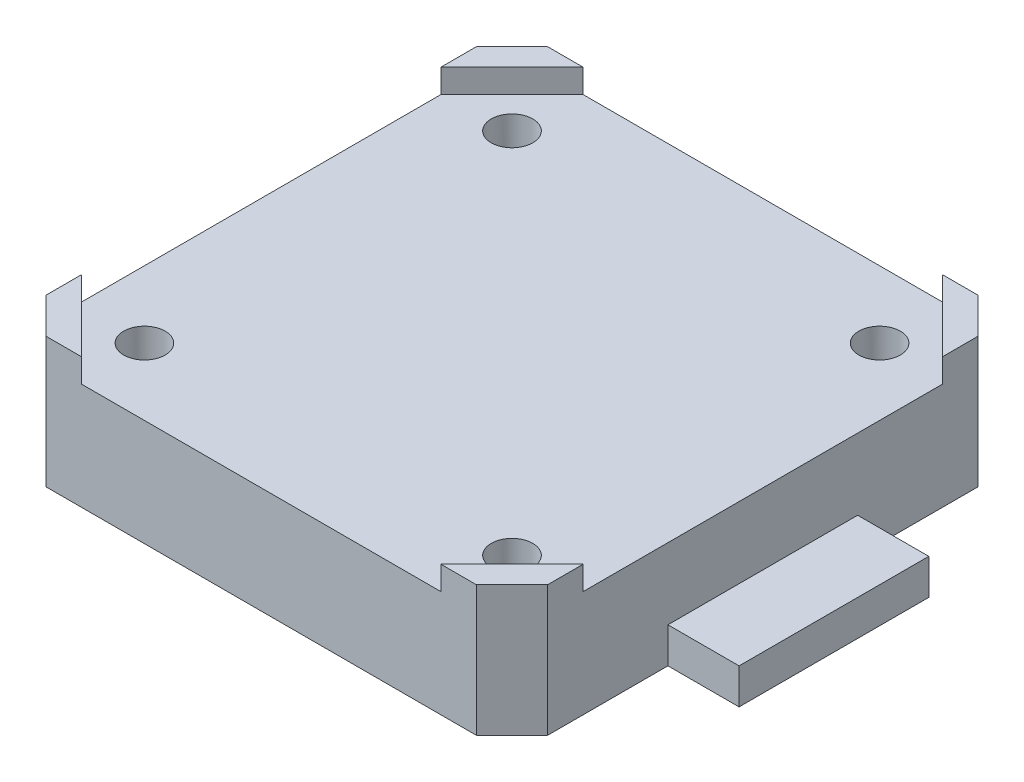
ISO-10303-21;
HEADER;
FILE_DESCRIPTION(('STEP AP214'),'2;1');
FILE_NAME('part.step','',(''),(''),'','','');
FILE_SCHEMA(('AUTOMOTIVE_DESIGN { 1 0 10303 214 1 1 1 1 }'));
ENDSEC;
DATA;
#1=APPLICATION_CONTEXT('core data for automotive mechanical design processes');
#2=APPLICATION_PROTOCOL_DEFINITION('international standard','automotive_design',2000,#1);
#3=PRODUCT_CONTEXT('',#1,'mechanical');
#4=PRODUCT('Part','Part','',(#3));
#5=PRODUCT_RELATED_PRODUCT_CATEGORY('part','',(#4));
#6=PRODUCT_DEFINITION_FORMATION('','',#4);
#7=PRODUCT_DEFINITION_CONTEXT('part definition',#1,'design');
#8=PRODUCT_DEFINITION('design','',#6,#7);
#9=PRODUCT_DEFINITION_SHAPE('','',#8);
#10=(LENGTH_UNIT() NAMED_UNIT(*) SI_UNIT(.MILLI.,.METRE.));
#11=(NAMED_UNIT(*) PLANE_ANGLE_UNIT() SI_UNIT($,.RADIAN.));
#12=(NAMED_UNIT(*) SI_UNIT($,.STERADIAN.) SOLID_ANGLE_UNIT());
#13=UNCERTAINTY_MEASURE_WITH_UNIT(LENGTH_MEASURE(1.E-05),#10,'distance_accuracy_value','');
#14=(GEOMETRIC_REPRESENTATION_CONTEXT(3) GLOBAL_UNCERTAINTY_ASSIGNED_CONTEXT((#13)) GLOBAL_UNIT_ASSIGNED_CONTEXT((#10,
#11,#12)) REPRESENTATION_CONTEXT('',''));
#15=CARTESIAN_POINT('',(0.,0.,0.));
#16=DIRECTION('',(0.,0.,1.));
#17=DIRECTION('',(1.,0.,0.));
#18=AXIS2_PLACEMENT_3D('',#15,#16,#17);
#19=CARTESIAN_POINT('',(0.,0.,0.));
#20=DIRECTION('',(0.,1.,0.));
#21=DIRECTION('',(1.,0.,0.));
#22=AXIS2_PLACEMENT_3D('',#19,#20,#21);
#23=PLANE('',#22);
#24=CARTESIAN_POINT('',(15.5,0.,-15.5));
#25=DIRECTION('',(0.,1.,0.));
#26=DIRECTION('',(0.,0.,-1.));
#27=AXIS2_PLACEMENT_3D('',#24,#25,#26);
#28=CIRCLE('',#27,2.875);
#29=CARTESIAN_POINT('',(15.5,0.,-18.375));
#30=VERTEX_POINT('',#29);
#31=CARTESIAN_POINT('',(15.5,0.,-12.625));
#32=VERTEX_POINT('',#31);
#33=EDGE_CURVE('E354',#30,#32,#28,.T.);
#34=ORIENTED_EDGE('',*,*,#33,.T.);
#35=CARTESIAN_POINT('',(15.5,0.,-15.5));
#36=DIRECTION('',(0.,1.,0.));
#37=DIRECTION('',(0.,0.,-1.));
#38=AXIS2_PLACEMENT_3D('',#35,#36,#37);
#39=CIRCLE('',#38,2.875);
#40=EDGE_CURVE('E183',#32,#30,#39,.T.);
#41=ORIENTED_EDGE('',*,*,#40,.T.);
#42=EDGE_LOOP('',(#34,#41));
#43=FACE_BOUND('',#42,.T.);
#44=CARTESIAN_POINT('',(-15.5,0.,15.5));
#45=DIRECTION('',(0.,1.,0.));
#46=DIRECTION('',(0.,0.,-1.));
#47=AXIS2_PLACEMENT_3D('',#44,#45,#46);
#48=CIRCLE('',#47,2.875);
#49=CARTESIAN_POINT('',(-15.5,0.,12.625));
#50=VERTEX_POINT('',#49);
#51=CARTESIAN_POINT('',(-15.5,0.,18.375));
#52=VERTEX_POINT('',#51);
#53=EDGE_CURVE('E420',#50,#52,#48,.T.);
#54=ORIENTED_EDGE('',*,*,#53,.T.);
#55=CARTESIAN_POINT('',(-15.5,0.,15.5));
#56=DIRECTION('',(0.,1.,0.));
#57=DIRECTION('',(0.,0.,-1.));
#58=AXIS2_PLACEMENT_3D('',#55,#56,#57);
#59=CIRCLE('',#58,2.875);
#60=EDGE_CURVE('E312',#52,#50,#59,.T.);
#61=ORIENTED_EDGE('',*,*,#60,.T.);
#62=EDGE_LOOP('',(#54,#61));
#63=FACE_BOUND('',#62,.T.);
#64=CARTESIAN_POINT('',(15.5,0.,15.5));
#65=DIRECTION('',(0.,1.,0.));
#66=DIRECTION('',(0.,0.,-1.));
#67=AXIS2_PLACEMENT_3D('',#64,#65,#66);
#68=CIRCLE('',#67,2.875);
#69=CARTESIAN_POINT('',(15.5,0.,12.625));
#70=VERTEX_POINT('',#69);
#71=CARTESIAN_POINT('',(15.5,0.,18.375));
#72=VERTEX_POINT('',#71);
#73=EDGE_CURVE('E479',#70,#72,#68,.T.);
#74=ORIENTED_EDGE('',*,*,#73,.T.);
#75=CARTESIAN_POINT('',(15.5,0.,15.5));
#76=DIRECTION('',(0.,1.,0.));
#77=DIRECTION('',(0.,0.,-1.));
#78=AXIS2_PLACEMENT_3D('',#75,#76,#77);
#79=CIRCLE('',#78,2.875);
#80=EDGE_CURVE('E359',#72,#70,#79,.T.);
#81=ORIENTED_EDGE('',*,*,#80,.T.);
#82=EDGE_LOOP('',(#74,#81));
#83=FACE_BOUND('',#82,.T.);
#84=CARTESIAN_POINT('',(-15.5,0.,-15.5));
#85=DIRECTION('',(0.,1.,0.));
#86=DIRECTION('',(0.,0.,-1.));
#87=AXIS2_PLACEMENT_3D('',#84,#85,#86);
#88=CIRCLE('',#87,2.875);
#89=CARTESIAN_POINT('',(-15.5,0.,-18.375));
#90=VERTEX_POINT('',#89);
#91=CARTESIAN_POINT('',(-15.5,0.,-12.625));
#92=VERTEX_POINT('',#91);
#93=EDGE_CURVE('E415',#90,#92,#88,.T.);
#94=ORIENTED_EDGE('',*,*,#93,.T.);
#95=CARTESIAN_POINT('',(-15.5,0.,-15.5));
#96=DIRECTION('',(0.,1.,0.));
#97=DIRECTION('',(0.,0.,-1.));
#98=AXIS2_PLACEMENT_3D('',#95,#96,#97);
#99=CIRCLE('',#98,2.875);
#100=EDGE_CURVE('E345',#92,#90,#99,.T.);
#101=ORIENTED_EDGE('',*,*,#100,.T.);
#102=EDGE_LOOP('',(#94,#101));
#103=FACE_BOUND('',#102,.T.);
#104=DIRECTION('',(-0.707106781186531,0.,-0.707106781186564));
#105=VECTOR('',#104,1.);
#106=CARTESIAN_POINT('',(21.15,0.,-18.15));
#107=LINE('',#106,#105);
#108=CARTESIAN_POINT('',(21.15,0.,-18.15));
#109=VERTEX_POINT('',#108);
#110=CARTESIAN_POINT('',(18.15,0.,-21.15));
#111=VERTEX_POINT('',#110);
#112=EDGE_CURVE('E11',#109,#111,#107,.T.);
#113=ORIENTED_EDGE('',*,*,#112,.F.);
#114=DIRECTION('',(0.,0.,-1.));
#115=VECTOR('',#114,1.);
#116=CARTESIAN_POINT('',(21.15,0.,18.15));
#117=LINE('',#116,#115);
#118=CARTESIAN_POINT('',(21.15,0.,-8.));
#119=VERTEX_POINT('',#118);
#120=EDGE_CURVE('E563',#119,#109,#117,.T.);
#121=ORIENTED_EDGE('',*,*,#120,.F.);
#122=DIRECTION('',(1.,0.,0.));
#123=VECTOR('',#122,1.);
#124=CARTESIAN_POINT('',(21.15,0.,-8.));
#125=LINE('',#124,#123);
#126=CARTESIAN_POINT('',(27.15,0.,-8.));
#127=VERTEX_POINT('',#126);
#128=EDGE_CURVE('E430',#119,#127,#125,.T.);
#129=ORIENTED_EDGE('',*,*,#128,.T.);
#130=DIRECTION('',(0.,0.,-1.));
#131=VECTOR('',#130,1.);
#132=CARTESIAN_POINT('',(27.15,0.,8.));
#133=LINE('',#132,#131);
#134=CARTESIAN_POINT('',(27.15,0.,8.));
#135=VERTEX_POINT('',#134);
#136=EDGE_CURVE('E512',#135,#127,#133,.T.);
#137=ORIENTED_EDGE('',*,*,#136,.F.);
#138=DIRECTION('',(1.,0.,0.));
#139=VECTOR('',#138,1.);
#140=CARTESIAN_POINT('',(21.15,0.,8.));
#141=LINE('',#140,#139);
#142=CARTESIAN_POINT('',(21.15,0.,8.));
#143=VERTEX_POINT('',#142);
#144=EDGE_CURVE('E429',#143,#135,#141,.T.);
#145=ORIENTED_EDGE('',*,*,#144,.F.);
#146=DIRECTION('',(0.,0.,-1.));
#147=VECTOR('',#146,1.);
#148=CARTESIAN_POINT('',(21.15,0.,18.15));
#149=LINE('',#148,#147);
#150=CARTESIAN_POINT('',(21.15,0.,18.15));
#151=VERTEX_POINT('',#150);
#152=EDGE_CURVE('E387',#151,#143,#149,.T.);
#153=ORIENTED_EDGE('',*,*,#152,.F.);
#154=DIRECTION('',(-0.707106781186531,0.,0.707106781186564));
#155=VECTOR('',#154,1.);
#156=CARTESIAN_POINT('',(21.15,0.,18.15));
#157=LINE('',#156,#155);
#158=CARTESIAN_POINT('',(18.15,0.,21.15));
#159=VERTEX_POINT('',#158);
#160=EDGE_CURVE('E372',#151,#159,#157,.T.);
#161=ORIENTED_EDGE('',*,*,#160,.T.);
#162=DIRECTION('',(1.,0.,0.));
#163=VECTOR('',#162,1.);
#164=CARTESIAN_POINT('',(-18.15,0.,21.15));
#165=LINE('',#164,#163);
#166=CARTESIAN_POINT('',(-18.15,0.,21.15));
#167=VERTEX_POINT('',#166);
#168=EDGE_CURVE('E371',#167,#159,#165,.T.);
#169=ORIENTED_EDGE('',*,*,#168,.F.);
#170=DIRECTION('',(0.707106781186548,0.,0.707106781186548));
#171=VECTOR('',#170,1.);
#172=CARTESIAN_POINT('',(-21.15,0.,18.15));
#173=LINE('',#172,#171);
#174=CARTESIAN_POINT('',(-21.15,0.,18.15));
#175=VERTEX_POINT('',#174);
#176=EDGE_CURVE('E491',#175,#167,#173,.T.);
#177=ORIENTED_EDGE('',*,*,#176,.F.);
#178=DIRECTION('',(0.,0.,1.));
#179=VECTOR('',#178,1.);
#180=CARTESIAN_POINT('',(-21.15,0.,-18.15));
#181=LINE('',#180,#179);
#182=CARTESIAN_POINT('',(-21.15,0.,-18.15));
#183=VERTEX_POINT('',#182);
#184=EDGE_CURVE('E490',#183,#175,#181,.T.);
#185=ORIENTED_EDGE('',*,*,#184,.F.);
#186=DIRECTION('',(0.707106781186548,0.,-0.707106781186548));
#187=VECTOR('',#186,1.);
#188=CARTESIAN_POINT('',(-21.15,0.,-18.15));
#189=LINE('',#188,#187);
#190=CARTESIAN_POINT('',(-18.15,0.,-21.15));
#191=VERTEX_POINT('',#190);
#192=EDGE_CURVE('E376',#183,#191,#189,.T.);
#193=ORIENTED_EDGE('',*,*,#192,.T.);
#194=DIRECTION('',(-1.,0.,0.));
#195=VECTOR('',#194,1.);
#196=CARTESIAN_POINT('',(18.15,0.,-21.15));
#197=LINE('',#196,#195);
#198=EDGE_CURVE('E334',#111,#191,#197,.T.);
#199=ORIENTED_EDGE('',*,*,#198,.F.);
#200=EDGE_LOOP('',(#113,#121,#129,#137,#145,#153,#161,#169,#177,#185,#193,#199));
#201=FACE_BOUND('',#200,.T.);
#202=ADVANCED_FACE('F16',(#43,#63,#83,#103,#201),#23,.F.);
#203=CARTESIAN_POINT('',(0.,9.,0.));
#204=DIRECTION('',(0.,1.,0.));
#205=DIRECTION('',(1.,0.,0.));
#206=AXIS2_PLACEMENT_3D('',#203,#204,#205);
#207=PLANE('',#206);
#208=CARTESIAN_POINT('',(15.5,9.,-15.5));
#209=DIRECTION('',(0.,-1.,0.));
#210=DIRECTION('',(0.,0.,-1.));
#211=AXIS2_PLACEMENT_3D('',#208,#209,#210);
#212=CIRCLE('',#211,1.75);
#213=CARTESIAN_POINT('',(15.5,9.,-17.25));
#214=VERTEX_POINT('',#213);
#215=CARTESIAN_POINT('',(15.5,9.,-13.75));
#216=VERTEX_POINT('',#215);
#217=EDGE_CURVE('E425',#214,#216,#212,.T.);
#218=ORIENTED_EDGE('',*,*,#217,.T.);
#219=CARTESIAN_POINT('',(15.5,9.,-15.5));
#220=DIRECTION('',(0.,-1.,0.));
#221=DIRECTION('',(0.,0.,-1.));
#222=AXIS2_PLACEMENT_3D('',#219,#220,#221);
#223=CIRCLE('',#222,1.75);
#224=EDGE_CURVE('E421',#216,#214,#223,.T.);
#225=ORIENTED_EDGE('',*,*,#224,.T.);
#226=EDGE_LOOP('',(#218,#225));
#227=FACE_BOUND('',#226,.T.);
#228=CARTESIAN_POINT('',(-15.5,9.,15.5));
#229=DIRECTION('',(0.,-1.,0.));
#230=DIRECTION('',(0.,0.,-1.));
#231=AXIS2_PLACEMENT_3D('',#228,#229,#230);
#232=CIRCLE('',#231,1.75);
#233=CARTESIAN_POINT('',(-15.5,9.,13.75));
#234=VERTEX_POINT('',#233);
#235=CARTESIAN_POINT('',(-15.5,9.,17.25));
#236=VERTEX_POINT('',#235);
#237=EDGE_CURVE('E380',#234,#236,#232,.T.);
#238=ORIENTED_EDGE('',*,*,#237,.T.);
#239=CARTESIAN_POINT('',(-15.5,9.,15.5));
#240=DIRECTION('',(0.,-1.,0.));
#241=DIRECTION('',(0.,0.,-1.));
#242=AXIS2_PLACEMENT_3D('',#239,#240,#241);
#243=CIRCLE('',#242,1.75);
#244=EDGE_CURVE('E442',#236,#234,#243,.T.);
#245=ORIENTED_EDGE('',*,*,#244,.T.);
#246=EDGE_LOOP('',(#238,#245));
#247=FACE_BOUND('',#246,.T.);
#248=CARTESIAN_POINT('',(15.5,9.,15.5));
#249=DIRECTION('',(0.,-1.,0.));
#250=DIRECTION('',(0.,0.,-1.));
#251=AXIS2_PLACEMENT_3D('',#248,#249,#250);
#252=CIRCLE('',#251,1.75);
#253=CARTESIAN_POINT('',(15.5,9.,13.75));
#254=VERTEX_POINT('',#253);
#255=CARTESIAN_POINT('',(15.5,9.,17.25));
#256=VERTEX_POINT('',#255);
#257=EDGE_CURVE('E330',#254,#256,#252,.T.);
#258=ORIENTED_EDGE('',*,*,#257,.T.);
#259=CARTESIAN_POINT('',(15.5,9.,15.5));
#260=DIRECTION('',(0.,-1.,0.));
#261=DIRECTION('',(0.,0.,-1.));
#262=AXIS2_PLACEMENT_3D('',#259,#260,#261);
#263=CIRCLE('',#262,1.75);
#264=EDGE_CURVE('E324',#256,#254,#263,.T.);
#265=ORIENTED_EDGE('',*,*,#264,.T.);
#266=EDGE_LOOP('',(#258,#265));
#267=FACE_BOUND('',#266,.T.);
#268=CARTESIAN_POINT('',(-15.5,9.,-15.5));
#269=DIRECTION('',(0.,-1.,0.));
#270=DIRECTION('',(0.,0.,-1.));
#271=AXIS2_PLACEMENT_3D('',#268,#269,#270);
#272=CIRCLE('',#271,1.75);
#273=CARTESIAN_POINT('',(-15.5,9.,-17.25));
#274=VERTEX_POINT('',#273);
#275=CARTESIAN_POINT('',(-15.5,9.,-13.75));
#276=VERTEX_POINT('',#275);
#277=EDGE_CURVE('E363',#274,#276,#272,.T.);
#278=ORIENTED_EDGE('',*,*,#277,.T.);
#279=CARTESIAN_POINT('',(-15.5,9.,-15.5));
#280=DIRECTION('',(0.,-1.,0.));
#281=DIRECTION('',(0.,0.,-1.));
#282=AXIS2_PLACEMENT_3D('',#279,#280,#281);
#283=CIRCLE('',#282,1.75);
#284=EDGE_CURVE('E366',#276,#274,#283,.T.);
#285=ORIENTED_EDGE('',*,*,#284,.T.);
#286=EDGE_LOOP('',(#278,#285));
#287=FACE_BOUND('',#286,.T.);
#288=DIRECTION('',(0.707106781186548,0.,0.707106781186548));
#289=VECTOR('',#288,1.);
#290=CARTESIAN_POINT('',(-16.65,9.,19.65));
#291=LINE('',#290,#289);
#292=CARTESIAN_POINT('',(-21.15,9.,15.15));
#293=VERTEX_POINT('',#292);
#294=CARTESIAN_POINT('',(-15.15,9.,21.15));
#295=VERTEX_POINT('',#294);
#296=EDGE_CURVE('E515',#293,#295,#291,.T.);
#297=ORIENTED_EDGE('',*,*,#296,.T.);
#298=DIRECTION('',(1.,0.,0.));
#299=VECTOR('',#298,1.);
#300=CARTESIAN_POINT('',(-18.15,9.,21.15));
#301=LINE('',#300,#299);
#302=CARTESIAN_POINT('',(15.15,9.,21.15));
#303=VERTEX_POINT('',#302);
#304=EDGE_CURVE('E433',#295,#303,#301,.T.);
#305=ORIENTED_EDGE('',*,*,#304,.T.);
#306=DIRECTION('',(0.707106781186548,0.,-0.707106781186548));
#307=VECTOR('',#306,1.);
#308=CARTESIAN_POINT('',(19.65,9.,16.65));
#309=LINE('',#308,#307);
#310=CARTESIAN_POINT('',(21.15,9.,15.15));
#311=VERTEX_POINT('',#310);
#312=EDGE_CURVE('E396',#303,#311,#309,.T.);
#313=ORIENTED_EDGE('',*,*,#312,.T.);
#314=DIRECTION('',(0.,0.,-1.));
#315=VECTOR('',#314,1.);
#316=CARTESIAN_POINT('',(21.15,9.,18.15));
#317=LINE('',#316,#315);
#318=CARTESIAN_POINT('',(21.15,9.,-15.15));
#319=VERTEX_POINT('',#318);
#320=EDGE_CURVE('E577',#311,#319,#317,.T.);
#321=ORIENTED_EDGE('',*,*,#320,.T.);
#322=DIRECTION('',(-0.707106781186548,0.,-0.707106781186548));
#323=VECTOR('',#322,1.);
#324=CARTESIAN_POINT('',(16.65,9.,-19.65));
#325=LINE('',#324,#323);
#326=CARTESIAN_POINT('',(15.15,9.,-21.15));
#327=VERTEX_POINT('',#326);
#328=EDGE_CURVE('E340',#319,#327,#325,.T.);
#329=ORIENTED_EDGE('',*,*,#328,.T.);
#330=DIRECTION('',(-1.,0.,0.));
#331=VECTOR('',#330,1.);
#332=CARTESIAN_POINT('',(18.15,9.,-21.15));
#333=LINE('',#332,#331);
#334=CARTESIAN_POINT('',(-15.15,9.,-21.15));
#335=VERTEX_POINT('',#334);
#336=EDGE_CURVE('E362',#327,#335,#333,.T.);
#337=ORIENTED_EDGE('',*,*,#336,.T.);
#338=DIRECTION('',(-0.707106781186548,0.,0.707106781186548));
#339=VECTOR('',#338,1.);
#340=CARTESIAN_POINT('',(-19.65,9.,-16.65));
#341=LINE('',#340,#339);
#342=CARTESIAN_POINT('',(-21.15,9.,-15.15));
#343=VERTEX_POINT('',#342);
#344=EDGE_CURVE('E351',#335,#343,#341,.T.);
#345=ORIENTED_EDGE('',*,*,#344,.T.);
#346=DIRECTION('',(0.,0.,1.));
#347=VECTOR('',#346,1.);
#348=CARTESIAN_POINT('',(-21.15,9.,-18.15));
#349=LINE('',#348,#347);
#350=EDGE_CURVE('E412',#343,#293,#349,.T.);
#351=ORIENTED_EDGE('',*,*,#350,.T.);
#352=EDGE_LOOP('',(#297,#305,#313,#321,#329,#337,#345,#351));
#353=FACE_BOUND('',#352,.T.);
#354=ADVANCED_FACE('F594',(#227,#247,#267,#287,#353),#207,.T.);
#355=CARTESIAN_POINT('',(21.15,0.,-18.15));
#356=DIRECTION('',(0.707106781186564,0.,-0.707106781186531));
#357=DIRECTION('',(0.,-1.,0.));
#358=AXIS2_PLACEMENT_3D('',#355,#356,#357);
#359=PLANE('',#358);
#360=ORIENTED_EDGE('',*,*,#112,.T.);
#361=DIRECTION('',(0.,1.,0.));
#362=VECTOR('',#361,1.);
#363=CARTESIAN_POINT('',(18.15,0.,-21.15));
#364=LINE('',#363,#362);
#365=CARTESIAN_POINT('',(18.15,11.,-21.15));
#366=VERTEX_POINT('',#365);
#367=EDGE_CURVE('E27',#111,#366,#364,.T.);
#368=ORIENTED_EDGE('',*,*,#367,.T.);
#369=DIRECTION('',(-0.707106781186531,0.,-0.707106781186564));
#370=VECTOR('',#369,1.);
#371=CARTESIAN_POINT('',(20.4,11.,-18.9));
#372=LINE('',#371,#370);
#373=CARTESIAN_POINT('',(21.15,11.,-18.15));
#374=VERTEX_POINT('',#373);
#375=EDGE_CURVE('E474',#374,#366,#372,.T.);
#376=ORIENTED_EDGE('',*,*,#375,.F.);
#377=DIRECTION('',(0.,1.,0.));
#378=VECTOR('',#377,1.);
#379=CARTESIAN_POINT('',(21.15,0.,-18.15));
#380=LINE('',#379,#378);
#381=EDGE_CURVE('E580',#109,#374,#380,.T.);
#382=ORIENTED_EDGE('',*,*,#381,.F.);
#383=EDGE_LOOP('',(#360,#368,#376,#382));
#384=FACE_BOUND('',#383,.T.);
#385=ADVANCED_FACE('F717',(#384),#359,.T.);
#386=CARTESIAN_POINT('',(18.15,0.,-21.15));
#387=DIRECTION('',(0.,0.,-1.));
#388=DIRECTION('',(0.,-1.,0.));
#389=AXIS2_PLACEMENT_3D('',#386,#387,#388);
#390=PLANE('',#389);
#391=ORIENTED_EDGE('',*,*,#198,.T.);
#392=DIRECTION('',(0.,1.,0.));
#393=VECTOR('',#392,1.);
#394=CARTESIAN_POINT('',(-18.15,0.,-21.15));
#395=LINE('',#394,#393);
#396=CARTESIAN_POINT('',(-18.15,11.,-21.15));
#397=VERTEX_POINT('',#396);
#398=EDGE_CURVE('E373',#191,#397,#395,.T.);
#399=ORIENTED_EDGE('',*,*,#398,.T.);
#400=DIRECTION('',(-1.,0.,0.));
#401=VECTOR('',#400,1.);
#402=CARTESIAN_POINT('',(-7.575,11.,-21.15));
#403=LINE('',#402,#401);
#404=CARTESIAN_POINT('',(-15.15,11.,-21.15));
#405=VERTEX_POINT('',#404);
#406=EDGE_CURVE('E394',#405,#397,#403,.T.);
#407=ORIENTED_EDGE('',*,*,#406,.F.);
#408=DIRECTION('',(0.,1.,0.));
#409=VECTOR('',#408,1.);
#410=CARTESIAN_POINT('',(-15.15,9.,-21.15));
#411=LINE('',#410,#409);
#412=EDGE_CURVE('E346',#335,#405,#411,.T.);
#413=ORIENTED_EDGE('',*,*,#412,.F.);
#414=ORIENTED_EDGE('',*,*,#336,.F.);
#415=DIRECTION('',(0.,1.,0.));
#416=VECTOR('',#415,1.);
#417=CARTESIAN_POINT('',(15.15,9.,-21.15));
#418=LINE('',#417,#416);
#419=CARTESIAN_POINT('',(15.15,11.,-21.15));
#420=VERTEX_POINT('',#419);
#421=EDGE_CURVE('E462',#327,#420,#418,.T.);
#422=ORIENTED_EDGE('',*,*,#421,.T.);
#423=DIRECTION('',(-1.,0.,0.));
#424=VECTOR('',#423,1.);
#425=CARTESIAN_POINT('',(9.075,11.,-21.15));
#426=LINE('',#425,#424);
#427=EDGE_CURVE('E560',#366,#420,#426,.T.);
#428=ORIENTED_EDGE('',*,*,#427,.F.);
#429=ORIENTED_EDGE('',*,*,#367,.F.);
#430=EDGE_LOOP('',(#391,#399,#407,#413,#414,#422,#428,#429));
#431=FACE_BOUND('',#430,.T.);
#432=ADVANCED_FACE('F740',(#431),#390,.T.);
#433=CARTESIAN_POINT('',(-18.15,0.,-21.15));
#434=DIRECTION('',(-0.707106781186548,0.,-0.707106781186548));
#435=DIRECTION('',(-0.707106781186548,0.,0.707106781186548));
#436=AXIS2_PLACEMENT_3D('',#433,#434,#435);
#437=PLANE('',#436);
#438=ORIENTED_EDGE('',*,*,#192,.F.);
#439=DIRECTION('',(0.,1.,0.));
#440=VECTOR('',#439,1.);
#441=CARTESIAN_POINT('',(-21.15,0.,-18.15));
#442=LINE('',#441,#440);
#443=CARTESIAN_POINT('',(-21.15,11.,-18.15));
#444=VERTEX_POINT('',#443);
#445=EDGE_CURVE('E409',#183,#444,#442,.T.);
#446=ORIENTED_EDGE('',*,*,#445,.T.);
#447=DIRECTION('',(-0.707106781186548,0.,0.707106781186548));
#448=VECTOR('',#447,1.);
#449=CARTESIAN_POINT('',(-18.9,11.,-20.4));
#450=LINE('',#449,#448);
#451=EDGE_CURVE('E395',#397,#444,#450,.T.);
#452=ORIENTED_EDGE('',*,*,#451,.F.);
#453=ORIENTED_EDGE('',*,*,#398,.F.);
#454=EDGE_LOOP('',(#438,#446,#452,#453));
#455=FACE_BOUND('',#454,.T.);
#456=ADVANCED_FACE('F737',(#455),#437,.T.);
#457=CARTESIAN_POINT('',(-21.15,0.,-18.15));
#458=DIRECTION('',(-1.,0.,0.));
#459=DIRECTION('',(0.,0.,1.));
#460=AXIS2_PLACEMENT_3D('',#457,#458,#459);
#461=PLANE('',#460);
#462=ORIENTED_EDGE('',*,*,#184,.T.);
#463=DIRECTION('',(0.,1.,0.));
#464=VECTOR('',#463,1.);
#465=CARTESIAN_POINT('',(-21.15,0.,18.15));
#466=LINE('',#465,#464);
#467=CARTESIAN_POINT('',(-21.15,11.,18.15));
#468=VERTEX_POINT('',#467);
#469=EDGE_CURVE('E487',#175,#468,#466,.T.);
#470=ORIENTED_EDGE('',*,*,#469,.T.);
#471=DIRECTION('',(0.,0.,1.));
#472=VECTOR('',#471,1.);
#473=CARTESIAN_POINT('',(-21.15,11.,7.575));
#474=LINE('',#473,#472);
#475=CARTESIAN_POINT('',(-21.15,11.,15.15));
#476=VERTEX_POINT('',#475);
#477=EDGE_CURVE('E381',#476,#468,#474,.T.);
#478=ORIENTED_EDGE('',*,*,#477,.F.);
#479=DIRECTION('',(0.,1.,0.));
#480=VECTOR('',#479,1.);
#481=CARTESIAN_POINT('',(-21.15,9.,15.15));
#482=LINE('',#481,#480);
#483=EDGE_CURVE('E559',#293,#476,#482,.T.);
#484=ORIENTED_EDGE('',*,*,#483,.F.);
#485=ORIENTED_EDGE('',*,*,#350,.F.);
#486=DIRECTION('',(0.,1.,0.));
#487=VECTOR('',#486,1.);
#488=CARTESIAN_POINT('',(-21.15,9.,-15.15));
#489=LINE('',#488,#487);
#490=CARTESIAN_POINT('',(-21.15,11.,-15.15));
#491=VERTEX_POINT('',#490);
#492=EDGE_CURVE('E545',#343,#491,#489,.T.);
#493=ORIENTED_EDGE('',*,*,#492,.T.);
#494=DIRECTION('',(0.,0.,1.));
#495=VECTOR('',#494,1.);
#496=CARTESIAN_POINT('',(-21.15,11.,-9.075));
#497=LINE('',#496,#495);
#498=EDGE_CURVE('E391',#444,#491,#497,.T.);
#499=ORIENTED_EDGE('',*,*,#498,.F.);
#500=ORIENTED_EDGE('',*,*,#445,.F.);
#501=EDGE_LOOP('',(#462,#470,#478,#484,#485,#493,#499,#500));
#502=FACE_BOUND('',#501,.T.);
#503=ADVANCED_FACE('F600',(#502),#461,.T.);
#504=CARTESIAN_POINT('',(-21.15,0.,18.15));
#505=DIRECTION('',(-0.707106781186548,0.,0.707106781186548));
#506=DIRECTION('',(0.,1.,0.));
#507=AXIS2_PLACEMENT_3D('',#504,#505,#506);
#508=PLANE('',#507);
#509=ORIENTED_EDGE('',*,*,#176,.T.);
#510=DIRECTION('',(0.,1.,0.));
#511=VECTOR('',#510,1.);
#512=CARTESIAN_POINT('',(-18.15,0.,21.15));
#513=LINE('',#512,#511);
#514=CARTESIAN_POINT('',(-18.15,11.,21.15));
#515=VERTEX_POINT('',#514);
#516=EDGE_CURVE('E523',#167,#515,#513,.T.);
#517=ORIENTED_EDGE('',*,*,#516,.T.);
#518=DIRECTION('',(0.707106781186548,0.,0.707106781186548));
#519=VECTOR('',#518,1.);
#520=CARTESIAN_POINT('',(-20.4,11.,18.9));
#521=LINE('',#520,#519);
#522=EDGE_CURVE('E385',#468,#515,#521,.T.);
#523=ORIENTED_EDGE('',*,*,#522,.F.);
#524=ORIENTED_EDGE('',*,*,#469,.F.);
#525=EDGE_LOOP('',(#509,#517,#523,#524));
#526=FACE_BOUND('',#525,.T.);
#527=ADVANCED_FACE('F736',(#526),#508,.T.);
#528=CARTESIAN_POINT('',(-18.15,0.,21.15));
#529=DIRECTION('',(0.,0.,1.));
#530=DIRECTION('',(1.,0.,0.));
#531=AXIS2_PLACEMENT_3D('',#528,#529,#530);
#532=PLANE('',#531);
#533=ORIENTED_EDGE('',*,*,#168,.T.);
#534=DIRECTION('',(0.,1.,0.));
#535=VECTOR('',#534,1.);
#536=CARTESIAN_POINT('',(18.15,0.,21.15));
#537=LINE('',#536,#535);
#538=CARTESIAN_POINT('',(18.15,11.,21.15));
#539=VERTEX_POINT('',#538);
#540=EDGE_CURVE('E368',#159,#539,#537,.T.);
#541=ORIENTED_EDGE('',*,*,#540,.T.);
#542=DIRECTION('',(1.,0.,0.));
#543=VECTOR('',#542,1.);
#544=CARTESIAN_POINT('',(7.575,11.,21.15));
#545=LINE('',#544,#543);
#546=CARTESIAN_POINT('',(15.15,11.,21.15));
#547=VERTEX_POINT('',#546);
#548=EDGE_CURVE('E336',#547,#539,#545,.T.);
#549=ORIENTED_EDGE('',*,*,#548,.F.);
#550=DIRECTION('',(0.,1.,0.));
#551=VECTOR('',#550,1.);
#552=CARTESIAN_POINT('',(15.15,9.,21.15));
#553=LINE('',#552,#551);
#554=EDGE_CURVE('E400',#303,#547,#553,.T.);
#555=ORIENTED_EDGE('',*,*,#554,.F.);
#556=ORIENTED_EDGE('',*,*,#304,.F.);
#557=DIRECTION('',(0.,1.,0.));
#558=VECTOR('',#557,1.);
#559=CARTESIAN_POINT('',(-15.15,9.,21.15));
#560=LINE('',#559,#558);
#561=CARTESIAN_POINT('',(-15.15,11.,21.15));
#562=VERTEX_POINT('',#561);
#563=EDGE_CURVE('E386',#295,#562,#560,.T.);
#564=ORIENTED_EDGE('',*,*,#563,.T.);
#565=DIRECTION('',(1.,0.,0.));
#566=VECTOR('',#565,1.);
#567=CARTESIAN_POINT('',(-9.075,11.,21.15));
#568=LINE('',#567,#566);
#569=EDGE_CURVE('E464',#515,#562,#568,.T.);
#570=ORIENTED_EDGE('',*,*,#569,.F.);
#571=ORIENTED_EDGE('',*,*,#516,.F.);
#572=EDGE_LOOP('',(#533,#541,#549,#555,#556,#564,#570,#571));
#573=FACE_BOUND('',#572,.T.);
#574=ADVANCED_FACE('F747',(#573),#532,.T.);
#575=CARTESIAN_POINT('',(18.15,0.,21.15));
#576=DIRECTION('',(0.707106781186564,0.,0.707106781186531));
#577=DIRECTION('',(0.,-1.,0.));
#578=AXIS2_PLACEMENT_3D('',#575,#576,#577);
#579=PLANE('',#578);
#580=ORIENTED_EDGE('',*,*,#160,.F.);
#581=DIRECTION('',(0.,1.,0.));
#582=VECTOR('',#581,1.);
#583=CARTESIAN_POINT('',(21.15,0.,18.15));
#584=LINE('',#583,#582);
#585=CARTESIAN_POINT('',(21.15,11.,18.15));
#586=VERTEX_POINT('',#585);
#587=EDGE_CURVE('E390',#151,#586,#584,.T.);
#588=ORIENTED_EDGE('',*,*,#587,.T.);
#589=DIRECTION('',(0.707106781186531,0.,-0.707106781186564));
#590=VECTOR('',#589,1.);
#591=CARTESIAN_POINT('',(18.9000000000003,11.,20.4));
#592=LINE('',#591,#590);
#593=EDGE_CURVE('E546',#539,#586,#592,.T.);
#594=ORIENTED_EDGE('',*,*,#593,.F.);
#595=ORIENTED_EDGE('',*,*,#540,.F.);
#596=EDGE_LOOP('',(#580,#588,#594,#595));
#597=FACE_BOUND('',#596,.T.);
#598=ADVANCED_FACE('F750',(#597),#579,.T.);
#599=CARTESIAN_POINT('',(21.15,0.,18.15));
#600=DIRECTION('',(1.,0.,0.));
#601=DIRECTION('',(0.,1.,0.));
#602=AXIS2_PLACEMENT_3D('',#599,#600,#601);
#603=PLANE('',#602);
#604=DIRECTION('',(0.,-1.,0.));
#605=VECTOR('',#604,1.);
#606=CARTESIAN_POINT('',(21.15,0.,-8.));
#607=LINE('',#606,#605);
#608=CARTESIAN_POINT('',(21.15,3.,-8.));
#609=VERTEX_POINT('',#608);
#610=EDGE_CURVE('E504',#609,#119,#607,.T.);
#611=ORIENTED_EDGE('',*,*,#610,.T.);
#612=ORIENTED_EDGE('',*,*,#120,.T.);
#613=ORIENTED_EDGE('',*,*,#381,.T.);
#614=DIRECTION('',(0.,0.,-1.));
#615=VECTOR('',#614,1.);
#616=CARTESIAN_POINT('',(21.15,11.,-7.575));
#617=LINE('',#616,#615);
#618=CARTESIAN_POINT('',(21.15,11.,-15.15));
#619=VERTEX_POINT('',#618);
#620=EDGE_CURVE('E470',#619,#374,#617,.T.);
#621=ORIENTED_EDGE('',*,*,#620,.F.);
#622=DIRECTION('',(0.,1.,0.));
#623=VECTOR('',#622,1.);
#624=CARTESIAN_POINT('',(21.15,9.,-15.15));
#625=LINE('',#624,#623);
#626=EDGE_CURVE('E463',#319,#619,#625,.T.);
#627=ORIENTED_EDGE('',*,*,#626,.F.);
#628=ORIENTED_EDGE('',*,*,#320,.F.);
#629=DIRECTION('',(0.,1.,0.));
#630=VECTOR('',#629,1.);
#631=CARTESIAN_POINT('',(21.15,9.,15.15));
#632=LINE('',#631,#630);
#633=CARTESIAN_POINT('',(21.15,11.,15.15));
#634=VERTEX_POINT('',#633);
#635=EDGE_CURVE('E550',#311,#634,#632,.T.);
#636=ORIENTED_EDGE('',*,*,#635,.T.);
#637=DIRECTION('',(0.,0.,-1.));
#638=VECTOR('',#637,1.);
#639=CARTESIAN_POINT('',(21.15,11.,9.075));
#640=LINE('',#639,#638);
#641=EDGE_CURVE('E341',#586,#634,#640,.T.);
#642=ORIENTED_EDGE('',*,*,#641,.F.);
#643=ORIENTED_EDGE('',*,*,#587,.F.);
#644=ORIENTED_EDGE('',*,*,#152,.T.);
#645=DIRECTION('',(0.,1.,0.));
#646=VECTOR('',#645,1.);
#647=CARTESIAN_POINT('',(21.15,1.5,8.));
#648=LINE('',#647,#646);
#649=CARTESIAN_POINT('',(21.15,3.,8.));
#650=VERTEX_POINT('',#649);
#651=EDGE_CURVE('E426',#143,#650,#648,.T.);
#652=ORIENTED_EDGE('',*,*,#651,.T.);
#653=DIRECTION('',(0.,0.,-1.));
#654=VECTOR('',#653,1.);
#655=CARTESIAN_POINT('',(21.15,3.,5.075));
#656=LINE('',#655,#654);
#657=EDGE_CURVE('E424',#650,#609,#656,.T.);
#658=ORIENTED_EDGE('',*,*,#657,.T.);
#659=EDGE_LOOP('',(#611,#612,#613,#621,#627,#628,#636,#642,#643,#644,#652,#658));
#660=FACE_BOUND('',#659,.T.);
#661=ADVANCED_FACE('F1054',(#660),#603,.T.);
#662=CARTESIAN_POINT('',(0.,11.,0.));
#663=DIRECTION('',(0.,1.,0.));
#664=DIRECTION('',(1.,0.,0.));
#665=AXIS2_PLACEMENT_3D('',#662,#663,#664);
#666=PLANE('',#665);
#667=ORIENTED_EDGE('',*,*,#620,.T.);
#668=ORIENTED_EDGE('',*,*,#375,.T.);
#669=ORIENTED_EDGE('',*,*,#427,.T.);
#670=DIRECTION('',(0.707106781186548,0.,0.707106781186548));
#671=VECTOR('',#670,1.);
#672=CARTESIAN_POINT('',(16.65,11.,-19.65));
#673=LINE('',#672,#671);
#674=EDGE_CURVE('E458',#420,#619,#673,.T.);
#675=ORIENTED_EDGE('',*,*,#674,.T.);
#676=EDGE_LOOP('',(#667,#668,#669,#675));
#677=FACE_BOUND('',#676,.T.);
#678=ADVANCED_FACE('F763',(#677),#666,.T.);
#679=CARTESIAN_POINT('',(15.15,9.,-21.15));
#680=DIRECTION('',(-0.707106781186548,0.,0.707106781186548));
#681=DIRECTION('',(0.,1.,0.));
#682=AXIS2_PLACEMENT_3D('',#679,#680,#681);
#683=PLANE('',#682);
#684=ORIENTED_EDGE('',*,*,#328,.F.);
#685=ORIENTED_EDGE('',*,*,#626,.T.);
#686=ORIENTED_EDGE('',*,*,#674,.F.);
#687=ORIENTED_EDGE('',*,*,#421,.F.);
#688=EDGE_LOOP('',(#684,#685,#686,#687));
#689=FACE_BOUND('',#688,.T.);
#690=ADVANCED_FACE('F759',(#689),#683,.T.);
#691=CARTESIAN_POINT('',(0.,11.,0.));
#692=DIRECTION('',(0.,1.,0.));
#693=DIRECTION('',(1.,0.,0.));
#694=AXIS2_PLACEMENT_3D('',#691,#692,#693);
#695=PLANE('',#694);
#696=ORIENTED_EDGE('',*,*,#593,.T.);
#697=ORIENTED_EDGE('',*,*,#641,.T.);
#698=DIRECTION('',(-0.707106781186548,0.,0.707106781186548));
#699=VECTOR('',#698,1.);
#700=CARTESIAN_POINT('',(19.65,11.,16.65));
#701=LINE('',#700,#699);
#702=EDGE_CURVE('E573',#634,#547,#701,.T.);
#703=ORIENTED_EDGE('',*,*,#702,.T.);
#704=ORIENTED_EDGE('',*,*,#548,.T.);
#705=EDGE_LOOP('',(#696,#697,#703,#704));
#706=FACE_BOUND('',#705,.T.);
#707=ADVANCED_FACE('F762',(#706),#695,.T.);
#708=CARTESIAN_POINT('',(21.15,9.,15.15));
#709=DIRECTION('',(-0.707106781186548,0.,-0.707106781186548));
#710=DIRECTION('',(-0.707106781186548,0.,0.707106781186548));
#711=AXIS2_PLACEMENT_3D('',#708,#709,#710);
#712=PLANE('',#711);
#713=ORIENTED_EDGE('',*,*,#312,.F.);
#714=ORIENTED_EDGE('',*,*,#554,.T.);
#715=ORIENTED_EDGE('',*,*,#702,.F.);
#716=ORIENTED_EDGE('',*,*,#635,.F.);
#717=EDGE_LOOP('',(#713,#714,#715,#716));
#718=FACE_BOUND('',#717,.T.);
#719=ADVANCED_FACE('F755',(#718),#712,.T.);
#720=CARTESIAN_POINT('',(0.,11.,0.));
#721=DIRECTION('',(0.,1.,0.));
#722=DIRECTION('',(1.,0.,0.));
#723=AXIS2_PLACEMENT_3D('',#720,#721,#722);
#724=PLANE('',#723);
#725=ORIENTED_EDGE('',*,*,#451,.T.);
#726=ORIENTED_EDGE('',*,*,#498,.T.);
#727=DIRECTION('',(0.707106781186548,0.,-0.707106781186548));
#728=VECTOR('',#727,1.);
#729=CARTESIAN_POINT('',(-19.65,11.,-16.65));
#730=LINE('',#729,#728);
#731=EDGE_CURVE('E350',#491,#405,#730,.T.);
#732=ORIENTED_EDGE('',*,*,#731,.T.);
#733=ORIENTED_EDGE('',*,*,#406,.T.);
#734=EDGE_LOOP('',(#725,#726,#732,#733));
#735=FACE_BOUND('',#734,.T.);
#736=ADVANCED_FACE('F751',(#735),#724,.T.);
#737=CARTESIAN_POINT('',(-21.15,9.,-15.15));
#738=DIRECTION('',(0.707106781186548,0.,0.707106781186548));
#739=DIRECTION('',(0.,-1.,0.));
#740=AXIS2_PLACEMENT_3D('',#737,#738,#739);
#741=PLANE('',#740);
#742=ORIENTED_EDGE('',*,*,#344,.F.);
#743=ORIENTED_EDGE('',*,*,#412,.T.);
#744=ORIENTED_EDGE('',*,*,#731,.F.);
#745=ORIENTED_EDGE('',*,*,#492,.F.);
#746=EDGE_LOOP('',(#742,#743,#744,#745));
#747=FACE_BOUND('',#746,.T.);
#748=ADVANCED_FACE('F754',(#747),#741,.T.);
#749=CARTESIAN_POINT('',(0.,11.,0.));
#750=DIRECTION('',(0.,1.,0.));
#751=DIRECTION('',(1.,0.,0.));
#752=AXIS2_PLACEMENT_3D('',#749,#750,#751);
#753=PLANE('',#752);
#754=ORIENTED_EDGE('',*,*,#477,.T.);
#755=ORIENTED_EDGE('',*,*,#522,.T.);
#756=ORIENTED_EDGE('',*,*,#569,.T.);
#757=DIRECTION('',(-0.707106781186548,0.,-0.707106781186548));
#758=VECTOR('',#757,1.);
#759=CARTESIAN_POINT('',(-16.65,11.,19.65));
#760=LINE('',#759,#758);
#761=EDGE_CURVE('E605',#562,#476,#760,.T.);
#762=ORIENTED_EDGE('',*,*,#761,.T.);
#763=EDGE_LOOP('',(#754,#755,#756,#762));
#764=FACE_BOUND('',#763,.T.);
#765=ADVANCED_FACE('F768',(#764),#753,.T.);
#766=CARTESIAN_POINT('',(-15.15,9.,21.15));
#767=DIRECTION('',(0.707106781186548,0.,-0.707106781186548));
#768=DIRECTION('',(0.,-1.,0.));
#769=AXIS2_PLACEMENT_3D('',#766,#767,#768);
#770=PLANE('',#769);
#771=ORIENTED_EDGE('',*,*,#296,.F.);
#772=ORIENTED_EDGE('',*,*,#483,.T.);
#773=ORIENTED_EDGE('',*,*,#761,.F.);
#774=ORIENTED_EDGE('',*,*,#563,.F.);
#775=EDGE_LOOP('',(#771,#772,#773,#774));
#776=FACE_BOUND('',#775,.T.);
#777=ADVANCED_FACE('F608',(#776),#770,.T.);
#778=CARTESIAN_POINT('',(27.15,1.5,0.));
#779=DIRECTION('',(1.,0.,0.));
#780=DIRECTION('',(0.,1.,0.));
#781=AXIS2_PLACEMENT_3D('',#778,#779,#780);
#782=PLANE('',#781);
#783=DIRECTION('',(0.,-1.,0.));
#784=VECTOR('',#783,1.);
#785=CARTESIAN_POINT('',(27.15,3.,8.));
#786=LINE('',#785,#784);
#787=CARTESIAN_POINT('',(27.15,3.,8.));
#788=VERTEX_POINT('',#787);
#789=EDGE_CURVE('E441',#788,#135,#786,.T.);
#790=ORIENTED_EDGE('',*,*,#789,.T.);
#791=ORIENTED_EDGE('',*,*,#136,.T.);
#792=DIRECTION('',(0.,1.,0.));
#793=VECTOR('',#792,1.);
#794=CARTESIAN_POINT('',(27.15,0.,-8.));
#795=LINE('',#794,#793);
#796=CARTESIAN_POINT('',(27.15,3.,-8.));
#797=VERTEX_POINT('',#796);
#798=EDGE_CURVE('E508',#127,#797,#795,.T.);
#799=ORIENTED_EDGE('',*,*,#798,.T.);
#800=DIRECTION('',(0.,0.,1.));
#801=VECTOR('',#800,1.);
#802=CARTESIAN_POINT('',(27.15,3.,-8.));
#803=LINE('',#802,#801);
#804=EDGE_CURVE('E496',#797,#788,#803,.T.);
#805=ORIENTED_EDGE('',*,*,#804,.T.);
#806=EDGE_LOOP('',(#790,#791,#799,#805));
#807=FACE_BOUND('',#806,.T.);
#808=ADVANCED_FACE('F767',(#807),#782,.T.);
#809=CARTESIAN_POINT('',(21.15,3.,8.));
#810=DIRECTION('',(0.,0.,1.));
#811=DIRECTION('',(1.,0.,0.));
#812=AXIS2_PLACEMENT_3D('',#809,#810,#811);
#813=PLANE('',#812);
#814=ORIENTED_EDGE('',*,*,#651,.F.);
#815=ORIENTED_EDGE('',*,*,#144,.T.);
#816=ORIENTED_EDGE('',*,*,#789,.F.);
#817=DIRECTION('',(1.,0.,0.));
#818=VECTOR('',#817,1.);
#819=CARTESIAN_POINT('',(21.15,3.,8.));
#820=LINE('',#819,#818);
#821=EDGE_CURVE('E492',#650,#788,#820,.T.);
#822=ORIENTED_EDGE('',*,*,#821,.F.);
#823=EDGE_LOOP('',(#814,#815,#816,#822));
#824=FACE_BOUND('',#823,.T.);
#825=ADVANCED_FACE('F727',(#824),#813,.T.);
#826=CARTESIAN_POINT('',(21.15,0.,-8.));
#827=DIRECTION('',(0.,0.,-1.));
#828=DIRECTION('',(0.,-1.,0.));
#829=AXIS2_PLACEMENT_3D('',#826,#827,#828);
#830=PLANE('',#829);
#831=ORIENTED_EDGE('',*,*,#610,.F.);
#832=DIRECTION('',(1.,0.,0.));
#833=VECTOR('',#832,1.);
#834=CARTESIAN_POINT('',(21.15,3.,-8.));
#835=LINE('',#834,#833);
#836=EDGE_CURVE('E509',#609,#797,#835,.T.);
#837=ORIENTED_EDGE('',*,*,#836,.T.);
#838=ORIENTED_EDGE('',*,*,#798,.F.);
#839=ORIENTED_EDGE('',*,*,#128,.F.);
#840=EDGE_LOOP('',(#831,#837,#838,#839));
#841=FACE_BOUND('',#840,.T.);
#842=ADVANCED_FACE('F723',(#841),#830,.T.);
#843=CARTESIAN_POINT('',(21.15,3.,-8.));
#844=DIRECTION('',(0.,1.,0.));
#845=DIRECTION('',(1.,0.,0.));
#846=AXIS2_PLACEMENT_3D('',#843,#844,#845);
#847=PLANE('',#846);
#848=ORIENTED_EDGE('',*,*,#657,.F.);
#849=ORIENTED_EDGE('',*,*,#821,.T.);
#850=ORIENTED_EDGE('',*,*,#804,.F.);
#851=ORIENTED_EDGE('',*,*,#836,.F.);
#852=EDGE_LOOP('',(#848,#849,#850,#851));
#853=FACE_BOUND('',#852,.T.);
#854=ADVANCED_FACE('F726',(#853),#847,.T.);
#855=CARTESIAN_POINT('',(15.5,4.5,-15.5));
#856=DIRECTION('',(0.,1.,0.));
#857=DIRECTION('',(0.,0.,-1.));
#858=AXIS2_PLACEMENT_3D('',#855,#856,#857);
#859=CYLINDRICAL_SURFACE('',#858,1.75);
#860=CARTESIAN_POINT('',(15.5,3.,-15.5));
#861=DIRECTION('',(0.,1.,0.));
#862=DIRECTION('',(0.,0.,-1.));
#863=AXIS2_PLACEMENT_3D('',#860,#861,#862);
#864=CIRCLE('',#863,1.75);
#865=CARTESIAN_POINT('',(15.5,3.,-13.75));
#866=VERTEX_POINT('',#865);
#867=EDGE_CURVE('E437',#866,#866,#864,.T.);
#868=ORIENTED_EDGE('',*,*,#867,.F.);
#869=DIRECTION('',(0.,1.,0.));
#870=VECTOR('',#869,1.);
#871=CARTESIAN_POINT('',(15.5,4.5,-13.75));
#872=LINE('',#871,#870);
#873=EDGE_CURVE('E408',#866,#216,#872,.T.);
#874=ORIENTED_EDGE('',*,*,#873,.T.);
#875=ORIENTED_EDGE('',*,*,#217,.F.);
#876=ORIENTED_EDGE('',*,*,#224,.F.);
#877=ORIENTED_EDGE('',*,*,#873,.F.);
#878=EDGE_LOOP('',(#868,#874,#875,#876,#877));
#879=FACE_BOUND('',#878,.T.);
#880=ADVANCED_FACE('F729',(#879),#859,.F.);
#881=CARTESIAN_POINT('',(15.5,1.5,-15.5));
#882=DIRECTION('',(0.,1.,0.));
#883=DIRECTION('',(0.,0.,-1.));
#884=AXIS2_PLACEMENT_3D('',#881,#882,#883);
#885=CYLINDRICAL_SURFACE('',#884,2.875);
#886=ORIENTED_EDGE('',*,*,#33,.F.);
#887=ORIENTED_EDGE('',*,*,#40,.F.);
#888=DIRECTION('',(0.,1.,0.));
#889=VECTOR('',#888,1.);
#890=CARTESIAN_POINT('',(15.5,1.5,-12.625));
#891=LINE('',#890,#889);
#892=CARTESIAN_POINT('',(15.5,3.,-12.625));
#893=VERTEX_POINT('',#892);
#894=EDGE_CURVE('E173',#32,#893,#891,.T.);
#895=ORIENTED_EDGE('',*,*,#894,.T.);
#896=CARTESIAN_POINT('',(15.5,3.,-15.5));
#897=DIRECTION('',(0.,1.,0.));
#898=DIRECTION('',(0.,0.,-1.));
#899=AXIS2_PLACEMENT_3D('',#896,#897,#898);
#900=CIRCLE('',#899,2.875);
#901=CARTESIAN_POINT('',(15.5,3.,-18.375));
#902=VERTEX_POINT('',#901);
#903=EDGE_CURVE('E434',#893,#902,#900,.T.);
#904=ORIENTED_EDGE('',*,*,#903,.T.);
#905=CARTESIAN_POINT('',(15.5,3.,-15.5));
#906=DIRECTION('',(0.,1.,0.));
#907=DIRECTION('',(0.,0.,-1.));
#908=AXIS2_PLACEMENT_3D('',#905,#906,#907);
#909=CIRCLE('',#908,2.875);
#910=EDGE_CURVE('E438',#902,#893,#909,.T.);
#911=ORIENTED_EDGE('',*,*,#910,.T.);
#912=ORIENTED_EDGE('',*,*,#894,.F.);
#913=EDGE_LOOP('',(#886,#887,#895,#904,#911,#912));
#914=FACE_BOUND('',#913,.T.);
#915=ADVANCED_FACE('F732',(#914),#885,.F.);
#916=CARTESIAN_POINT('',(15.5,3.,-15.5));
#917=DIRECTION('',(0.,1.,0.));
#918=DIRECTION('',(1.,0.,0.));
#919=AXIS2_PLACEMENT_3D('',#916,#917,#918);
#920=PLANE('',#919);
#921=ORIENTED_EDGE('',*,*,#867,.T.);
#922=EDGE_LOOP('',(#921));
#923=FACE_BOUND('',#922,.T.);
#924=ORIENTED_EDGE('',*,*,#910,.F.);
#925=ORIENTED_EDGE('',*,*,#903,.F.);
#926=EDGE_LOOP('',(#924,#925));
#927=FACE_BOUND('',#926,.T.);
#928=ADVANCED_FACE('F745',(#923,#927),#920,.F.);
#929=CARTESIAN_POINT('',(-15.5,4.5,15.5));
#930=DIRECTION('',(0.,1.,0.));
#931=DIRECTION('',(0.,0.,-1.));
#932=AXIS2_PLACEMENT_3D('',#929,#930,#931);
#933=CYLINDRICAL_SURFACE('',#932,1.75);
#934=CARTESIAN_POINT('',(-15.5,3.,15.5));
#935=DIRECTION('',(0.,1.,0.));
#936=DIRECTION('',(0.,0.,-1.));
#937=AXIS2_PLACEMENT_3D('',#934,#935,#936);
#938=CIRCLE('',#937,1.75);
#939=CARTESIAN_POINT('',(-15.5,3.,17.25));
#940=VERTEX_POINT('',#939);
#941=EDGE_CURVE('E321',#940,#940,#938,.T.);
#942=ORIENTED_EDGE('',*,*,#941,.F.);
#943=DIRECTION('',(0.,1.,0.));
#944=VECTOR('',#943,1.);
#945=CARTESIAN_POINT('',(-15.5,4.5,17.25));
#946=LINE('',#945,#944);
#947=EDGE_CURVE('E315',#940,#236,#946,.T.);
#948=ORIENTED_EDGE('',*,*,#947,.T.);
#949=ORIENTED_EDGE('',*,*,#237,.F.);
#950=ORIENTED_EDGE('',*,*,#244,.F.);
#951=ORIENTED_EDGE('',*,*,#947,.F.);
#952=EDGE_LOOP('',(#942,#948,#949,#950,#951));
#953=FACE_BOUND('',#952,.T.);
#954=ADVANCED_FACE('F742',(#953),#933,.F.);
#955=CARTESIAN_POINT('',(-15.5,1.5,15.5));
#956=DIRECTION('',(0.,1.,0.));
#957=DIRECTION('',(0.,0.,-1.));
#958=AXIS2_PLACEMENT_3D('',#955,#956,#957);
#959=CYLINDRICAL_SURFACE('',#958,2.875);
#960=ORIENTED_EDGE('',*,*,#53,.F.);
#961=ORIENTED_EDGE('',*,*,#60,.F.);
#962=DIRECTION('',(0.,1.,0.));
#963=VECTOR('',#962,1.);
#964=CARTESIAN_POINT('',(-15.5,1.5,18.375));
#965=LINE('',#964,#963);
#966=CARTESIAN_POINT('',(-15.5,3.,18.375));
#967=VERTEX_POINT('',#966);
#968=EDGE_CURVE('E305',#52,#967,#965,.T.);
#969=ORIENTED_EDGE('',*,*,#968,.T.);
#970=CARTESIAN_POINT('',(-15.5,3.,15.5));
#971=DIRECTION('',(0.,1.,0.));
#972=DIRECTION('',(0.,0.,-1.));
#973=AXIS2_PLACEMENT_3D('',#970,#971,#972);
#974=CIRCLE('',#973,2.875);
#975=CARTESIAN_POINT('',(-15.5,3.,12.625));
#976=VERTEX_POINT('',#975);
#977=EDGE_CURVE('E310',#967,#976,#974,.T.);
#978=ORIENTED_EDGE('',*,*,#977,.T.);
#979=CARTESIAN_POINT('',(-15.5,3.,15.5));
#980=DIRECTION('',(0.,1.,0.));
#981=DIRECTION('',(0.,0.,-1.));
#982=AXIS2_PLACEMENT_3D('',#979,#980,#981);
#983=CIRCLE('',#982,2.875);
#984=EDGE_CURVE('E319',#976,#967,#983,.T.);
#985=ORIENTED_EDGE('',*,*,#984,.T.);
#986=ORIENTED_EDGE('',*,*,#968,.F.);
#987=EDGE_LOOP('',(#960,#961,#969,#978,#985,#986));
#988=FACE_BOUND('',#987,.T.);
#989=ADVANCED_FACE('F308',(#988),#959,.F.);
#990=CARTESIAN_POINT('',(-15.5,3.,15.5));
#991=DIRECTION('',(0.,1.,0.));
#992=DIRECTION('',(1.,0.,0.));
#993=AXIS2_PLACEMENT_3D('',#990,#991,#992);
#994=PLANE('',#993);
#995=ORIENTED_EDGE('',*,*,#941,.T.);
#996=EDGE_LOOP('',(#995));
#997=FACE_BOUND('',#996,.T.);
#998=ORIENTED_EDGE('',*,*,#984,.F.);
#999=ORIENTED_EDGE('',*,*,#977,.F.);
#1000=EDGE_LOOP('',(#998,#999));
#1001=FACE_BOUND('',#1000,.T.);
#1002=ADVANCED_FACE('F318',(#997,#1001),#994,.F.);
#1003=CARTESIAN_POINT('',(15.5,4.5,15.5));
#1004=DIRECTION('',(0.,1.,0.));
#1005=DIRECTION('',(0.,0.,-1.));
#1006=AXIS2_PLACEMENT_3D('',#1003,#1004,#1005);
#1007=CYLINDRICAL_SURFACE('',#1006,1.75);
#1008=CARTESIAN_POINT('',(15.5,3.,15.5));
#1009=DIRECTION('',(0.,1.,0.));
#1010=DIRECTION('',(0.,0.,-1.));
#1011=AXIS2_PLACEMENT_3D('',#1008,#1009,#1010);
#1012=CIRCLE('',#1011,1.75);
#1013=CARTESIAN_POINT('',(15.5,3.,17.25));
#1014=VERTEX_POINT('',#1013);
#1015=EDGE_CURVE('E475',#1014,#1014,#1012,.T.);
#1016=ORIENTED_EDGE('',*,*,#1015,.F.);
#1017=DIRECTION('',(0.,1.,0.));
#1018=VECTOR('',#1017,1.);
#1019=CARTESIAN_POINT('',(15.5,4.5,17.25));
#1020=LINE('',#1019,#1018);
#1021=EDGE_CURVE('E358',#1014,#256,#1020,.T.);
#1022=ORIENTED_EDGE('',*,*,#1021,.T.);
#1023=ORIENTED_EDGE('',*,*,#257,.F.);
#1024=ORIENTED_EDGE('',*,*,#264,.F.);
#1025=ORIENTED_EDGE('',*,*,#1021,.F.);
#1026=EDGE_LOOP('',(#1016,#1022,#1023,#1024,#1025));
#1027=FACE_BOUND('',#1026,.T.);
#1028=ADVANCED_FACE('F710',(#1027),#1007,.F.);
#1029=CARTESIAN_POINT('',(15.5,1.5,15.5));
#1030=DIRECTION('',(0.,1.,0.));
#1031=DIRECTION('',(0.,0.,-1.));
#1032=AXIS2_PLACEMENT_3D('',#1029,#1030,#1031);
#1033=CYLINDRICAL_SURFACE('',#1032,2.875);
#1034=ORIENTED_EDGE('',*,*,#73,.F.);
#1035=ORIENTED_EDGE('',*,*,#80,.F.);
#1036=DIRECTION('',(0.,1.,0.));
#1037=VECTOR('',#1036,1.);
#1038=CARTESIAN_POINT('',(15.5,1.5,18.375));
#1039=LINE('',#1038,#1037);
#1040=CARTESIAN_POINT('',(15.5,3.,18.375));
#1041=VERTEX_POINT('',#1040);
#1042=EDGE_CURVE('E355',#72,#1041,#1039,.T.);
#1043=ORIENTED_EDGE('',*,*,#1042,.T.);
#1044=CARTESIAN_POINT('',(15.5,3.,15.5));
#1045=DIRECTION('',(0.,1.,0.));
#1046=DIRECTION('',(0.,0.,-1.));
#1047=AXIS2_PLACEMENT_3D('',#1044,#1045,#1046);
#1048=CIRCLE('',#1047,2.875);
#1049=CARTESIAN_POINT('',(15.5,3.,12.625));
#1050=VERTEX_POINT('',#1049);
#1051=EDGE_CURVE('E480',#1041,#1050,#1048,.T.);
#1052=ORIENTED_EDGE('',*,*,#1051,.T.);
#1053=CARTESIAN_POINT('',(15.5,3.,15.5));
#1054=DIRECTION('',(0.,1.,0.));
#1055=DIRECTION('',(0.,0.,-1.));
#1056=AXIS2_PLACEMENT_3D('',#1053,#1054,#1055);
#1057=CIRCLE('',#1056,2.875);
#1058=EDGE_CURVE('E483',#1050,#1041,#1057,.T.);
#1059=ORIENTED_EDGE('',*,*,#1058,.T.);
#1060=ORIENTED_EDGE('',*,*,#1042,.F.);
#1061=EDGE_LOOP('',(#1034,#1035,#1043,#1052,#1059,#1060));
#1062=FACE_BOUND('',#1061,.T.);
#1063=ADVANCED_FACE('F696',(#1062),#1033,.F.);
#1064=CARTESIAN_POINT('',(15.5,3.,15.5));
#1065=DIRECTION('',(0.,1.,0.));
#1066=DIRECTION('',(1.,0.,0.));
#1067=AXIS2_PLACEMENT_3D('',#1064,#1065,#1066);
#1068=PLANE('',#1067);
#1069=ORIENTED_EDGE('',*,*,#1015,.T.);
#1070=EDGE_LOOP('',(#1069));
#1071=FACE_BOUND('',#1070,.T.);
#1072=ORIENTED_EDGE('',*,*,#1058,.F.);
#1073=ORIENTED_EDGE('',*,*,#1051,.F.);
#1074=EDGE_LOOP('',(#1072,#1073));
#1075=FACE_BOUND('',#1074,.T.);
#1076=ADVANCED_FACE('F18',(#1071,#1075),#1068,.F.);
#1077=CARTESIAN_POINT('',(-15.5,4.5,-15.5));
#1078=DIRECTION('',(0.,1.,0.));
#1079=DIRECTION('',(0.,0.,-1.));
#1080=AXIS2_PLACEMENT_3D('',#1077,#1078,#1079);
#1081=CYLINDRICAL_SURFACE('',#1080,1.75);
#1082=CARTESIAN_POINT('',(-15.5,3.,-15.5));
#1083=DIRECTION('',(0.,1.,0.));
#1084=DIRECTION('',(0.,0.,-1.));
#1085=AXIS2_PLACEMENT_3D('',#1082,#1083,#1084);
#1086=CIRCLE('',#1085,1.75);
#1087=CARTESIAN_POINT('',(-15.5,3.,-13.75));
#1088=VERTEX_POINT('',#1087);
#1089=EDGE_CURVE('E500',#1088,#1088,#1086,.T.);
#1090=ORIENTED_EDGE('',*,*,#1089,.F.);
#1091=DIRECTION('',(0.,1.,0.));
#1092=VECTOR('',#1091,1.);
#1093=CARTESIAN_POINT('',(-15.5,4.5,-13.75));
#1094=LINE('',#1093,#1092);
#1095=EDGE_CURVE('E20',#1088,#276,#1094,.T.);
#1096=ORIENTED_EDGE('',*,*,#1095,.T.);
#1097=ORIENTED_EDGE('',*,*,#277,.F.);
#1098=ORIENTED_EDGE('',*,*,#284,.F.);
#1099=ORIENTED_EDGE('',*,*,#1095,.F.);
#1100=EDGE_LOOP('',(#1090,#1096,#1097,#1098,#1099));
#1101=FACE_BOUND('',#1100,.T.);
#1102=ADVANCED_FACE('F701',(#1101),#1081,.F.);
#1103=CARTESIAN_POINT('',(-15.5,1.5,-15.5));
#1104=DIRECTION('',(0.,1.,0.));
#1105=DIRECTION('',(0.,0.,-1.));
#1106=AXIS2_PLACEMENT_3D('',#1103,#1104,#1105);
#1107=CYLINDRICAL_SURFACE('',#1106,2.875);
#1108=ORIENTED_EDGE('',*,*,#93,.F.);
#1109=ORIENTED_EDGE('',*,*,#100,.F.);
#1110=DIRECTION('',(0.,1.,0.));
#1111=VECTOR('',#1110,1.);
#1112=CARTESIAN_POINT('',(-15.5,1.5,-12.625));
#1113=LINE('',#1112,#1111);
#1114=CARTESIAN_POINT('',(-15.5,3.,-12.625));
#1115=VERTEX_POINT('',#1114);
#1116=EDGE_CURVE('E342',#92,#1115,#1113,.T.);
#1117=ORIENTED_EDGE('',*,*,#1116,.T.);
#1118=CARTESIAN_POINT('',(-15.5,3.,-15.5));
#1119=DIRECTION('',(0.,1.,0.));
#1120=DIRECTION('',(0.,0.,-1.));
#1121=AXIS2_PLACEMENT_3D('',#1118,#1119,#1120);
#1122=CIRCLE('',#1121,2.875);
#1123=CARTESIAN_POINT('',(-15.5,3.,-18.375));
#1124=VERTEX_POINT('',#1123);
#1125=EDGE_CURVE('E405',#1115,#1124,#1122,.T.);
#1126=ORIENTED_EDGE('',*,*,#1125,.T.);
#1127=CARTESIAN_POINT('',(-15.5,3.,-15.5));
#1128=DIRECTION('',(0.,1.,0.));
#1129=DIRECTION('',(0.,0.,-1.));
#1130=AXIS2_PLACEMENT_3D('',#1127,#1128,#1129);
#1131=CIRCLE('',#1130,2.875);
#1132=EDGE_CURVE('E401',#1124,#1115,#1131,.T.);
#1133=ORIENTED_EDGE('',*,*,#1132,.T.);
#1134=ORIENTED_EDGE('',*,*,#1116,.F.);
#1135=EDGE_LOOP('',(#1108,#1109,#1117,#1126,#1133,#1134));
#1136=FACE_BOUND('',#1135,.T.);
#1137=ADVANCED_FACE('F673',(#1136),#1107,.F.);
#1138=CARTESIAN_POINT('',(-15.5,3.,-15.5));
#1139=DIRECTION('',(0.,1.,0.));
#1140=DIRECTION('',(1.,0.,0.));
#1141=AXIS2_PLACEMENT_3D('',#1138,#1139,#1140);
#1142=PLANE('',#1141);
#1143=ORIENTED_EDGE('',*,*,#1089,.T.);
#1144=EDGE_LOOP('',(#1143));
#1145=FACE_BOUND('',#1144,.T.);
#1146=ORIENTED_EDGE('',*,*,#1132,.F.);
#1147=ORIENTED_EDGE('',*,*,#1125,.F.);
#1148=EDGE_LOOP('',(#1146,#1147));
#1149=FACE_BOUND('',#1148,.T.);
#1150=ADVANCED_FACE('F677',(#1145,#1149),#1142,.F.);
#1151=CLOSED_SHELL('',(#202,#354,#385,#432,#456,#503,#527,#574,#598,#661,#678,#690,#707,#719,
#736,#748,#765,#777,#808,#825,#842,#854,#880,#915,#928,#954,#989,#1002,#1028,#1063,#1076,#1102,
#1137,#1150));
#1152=MANIFOLD_SOLID_BREP('B1',#1151);
#1153=ADVANCED_BREP_SHAPE_REPRESENTATION('',(#18,#1152),#14);
#1154=SHAPE_DEFINITION_REPRESENTATION(#9,#1153);
ENDSEC;
END-ISO-10303-21;
